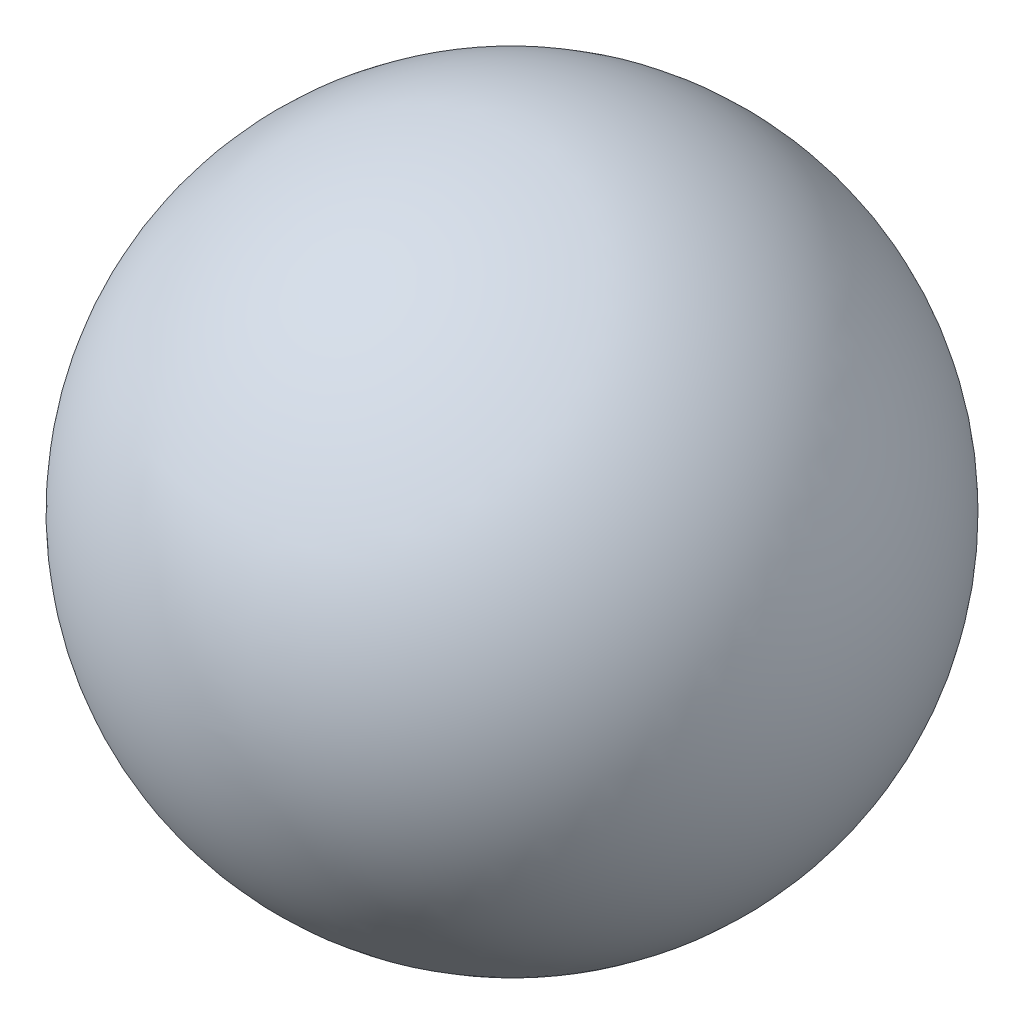
ISO-10303-21;
HEADER;
FILE_DESCRIPTION(('STEP AP214'),'2;1');
FILE_NAME('part.step','',(''),(''),'','','');
FILE_SCHEMA(('AUTOMOTIVE_DESIGN { 1 0 10303 214 1 1 1 1 }'));
ENDSEC;
DATA;
#1=APPLICATION_CONTEXT('core data for automotive mechanical design processes');
#2=APPLICATION_PROTOCOL_DEFINITION('international standard','automotive_design',2000,#1);
#3=PRODUCT_CONTEXT('',#1,'mechanical');
#4=PRODUCT('Part','Part','',(#3));
#5=PRODUCT_RELATED_PRODUCT_CATEGORY('part','',(#4));
#6=PRODUCT_DEFINITION_FORMATION('','',#4);
#7=PRODUCT_DEFINITION_CONTEXT('part definition',#1,'design');
#8=PRODUCT_DEFINITION('design','',#6,#7);
#9=PRODUCT_DEFINITION_SHAPE('','',#8);
#10=(LENGTH_UNIT() NAMED_UNIT(*) SI_UNIT(.MILLI.,.METRE.));
#11=(NAMED_UNIT(*) PLANE_ANGLE_UNIT() SI_UNIT($,.RADIAN.));
#12=(NAMED_UNIT(*) SI_UNIT($,.STERADIAN.) SOLID_ANGLE_UNIT());
#13=UNCERTAINTY_MEASURE_WITH_UNIT(LENGTH_MEASURE(1.E-05),#10,'distance_accuracy_value','');
#14=(GEOMETRIC_REPRESENTATION_CONTEXT(3) GLOBAL_UNCERTAINTY_ASSIGNED_CONTEXT((#13)) GLOBAL_UNIT_ASSIGNED_CONTEXT((#10,
#11,#12)) REPRESENTATION_CONTEXT('',''));
#15=CARTESIAN_POINT('',(0.,0.,0.));
#16=DIRECTION('',(0.,0.,1.));
#17=DIRECTION('',(1.,0.,0.));
#18=AXIS2_PLACEMENT_3D('',#15,#16,#17);
#19=CARTESIAN_POINT('',(64.16,69.1772975263212,5.33874479206882));
#20=DIRECTION('',(0.,0.997035261178115,0.0769460068326364));
#21=DIRECTION('',(0.173648177666934,-0.0757770240921106,0.981888055234759));
#22=AXIS2_PLACEMENT_3D('',#19,#20,#21);
#23=SPHERICAL_SURFACE('',#22,7.15);
#24=CARTESIAN_POINT('',(64.16,62.0484954088977,4.78858084321547));
#25=VERTEX_POINT('',#24);
#26=VERTEX_LOOP('',#25);
#27=FACE_BOUND('',#26,.T.);
#28=CARTESIAN_POINT('',(64.16,76.3060996437447,5.88890874092216));
#29=VERTEX_POINT('',#28);
#30=VERTEX_LOOP('',#29);
#31=FACE_BOUND('',#30,.T.);
#32=ADVANCED_FACE('F16',(#27,#31),#23,.T.);
#33=CLOSED_SHELL('',(#32));
#34=MANIFOLD_SOLID_BREP('B1',#33);
#35=ADVANCED_BREP_SHAPE_REPRESENTATION('',(#18,#34),#14);
#36=SHAPE_DEFINITION_REPRESENTATION(#9,#35);
ENDSEC;
END-ISO-10303-21;
